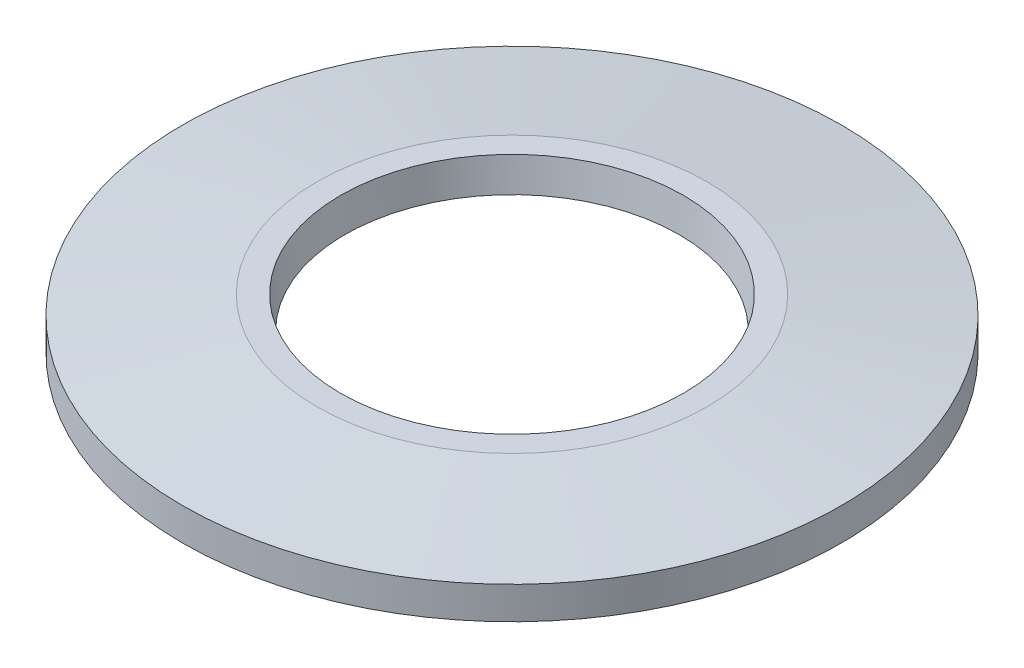
ISO-10303-21;
HEADER;
FILE_DESCRIPTION(('STEP AP214'),'2;1');
FILE_NAME('part.step','',(''),(''),'','','');
FILE_SCHEMA(('AUTOMOTIVE_DESIGN { 1 0 10303 214 1 1 1 1 }'));
ENDSEC;
DATA;
#1=APPLICATION_CONTEXT('core data for automotive mechanical design processes');
#2=APPLICATION_PROTOCOL_DEFINITION('international standard','automotive_design',2000,#1);
#3=PRODUCT_CONTEXT('',#1,'mechanical');
#4=PRODUCT('Part','Part','',(#3));
#5=PRODUCT_RELATED_PRODUCT_CATEGORY('part','',(#4));
#6=PRODUCT_DEFINITION_FORMATION('','',#4);
#7=PRODUCT_DEFINITION_CONTEXT('part definition',#1,'design');
#8=PRODUCT_DEFINITION('design','',#6,#7);
#9=PRODUCT_DEFINITION_SHAPE('','',#8);
#10=(LENGTH_UNIT() NAMED_UNIT(*) SI_UNIT(.MILLI.,.METRE.));
#11=(NAMED_UNIT(*) PLANE_ANGLE_UNIT() SI_UNIT($,.RADIAN.));
#12=(NAMED_UNIT(*) SI_UNIT($,.STERADIAN.) SOLID_ANGLE_UNIT());
#13=UNCERTAINTY_MEASURE_WITH_UNIT(LENGTH_MEASURE(1.E-05),#10,'distance_accuracy_value','');
#14=(GEOMETRIC_REPRESENTATION_CONTEXT(3) GLOBAL_UNCERTAINTY_ASSIGNED_CONTEXT((#13)) GLOBAL_UNIT_ASSIGNED_CONTEXT((#10,
#11,#12)) REPRESENTATION_CONTEXT('',''));
#15=CARTESIAN_POINT('',(0.,0.,0.));
#16=DIRECTION('',(0.,0.,1.));
#17=DIRECTION('',(1.,0.,0.));
#18=AXIS2_PLACEMENT_3D('',#15,#16,#17);
#19=CARTESIAN_POINT('',(0.,-9.29522380909999,0.));
#20=DIRECTION('',(0.,-1.,0.));
#21=DIRECTION('',(0.,0.,-1.));
#22=AXIS2_PLACEMENT_3D('',#19,#20,#21);
#23=CYLINDRICAL_SURFACE('',#22,14.);
#24=CARTESIAN_POINT('',(0.,-2.15,0.));
#25=DIRECTION('',(0.,-1.,0.));
#26=DIRECTION('',(0.,0.,-1.));
#27=AXIS2_PLACEMENT_3D('',#24,#25,#26);
#28=CIRCLE('',#27,14.);
#29=CARTESIAN_POINT('',(0.,-2.15,-14.));
#30=VERTEX_POINT('',#29);
#31=EDGE_CURVE('E10',#30,#30,#28,.T.);
#32=ORIENTED_EDGE('',*,*,#31,.F.);
#33=EDGE_LOOP('',(#32));
#34=FACE_BOUND('',#33,.T.);
#35=CARTESIAN_POINT('',(0.,-0.771320419024692,0.));
#36=DIRECTION('',(0.,-1.,0.));
#37=DIRECTION('',(0.,0.,-1.));
#38=AXIS2_PLACEMENT_3D('',#35,#36,#37);
#39=CIRCLE('',#38,14.);
#40=CARTESIAN_POINT('',(0.,-0.771320419024692,-14.));
#41=VERTEX_POINT('',#40);
#42=EDGE_CURVE('E51',#41,#41,#39,.T.);
#43=ORIENTED_EDGE('',*,*,#42,.T.);
#44=EDGE_LOOP('',(#43));
#45=FACE_BOUND('',#44,.T.);
#46=ADVANCED_FACE('F29',(#34,#45),#23,.T.);
#47=CARTESIAN_POINT('',(0.,-2.15,14.));
#48=DIRECTION('',(0.,1.,0.));
#49=DIRECTION('',(0.,0.,1.));
#50=AXIS2_PLACEMENT_3D('',#47,#48,#49);
#51=PLANE('',#50);
#52=CARTESIAN_POINT('',(0.,-2.15,0.));
#53=DIRECTION('',(0.,-1.,0.));
#54=DIRECTION('',(0.,0.,-1.));
#55=AXIS2_PLACEMENT_3D('',#52,#53,#54);
#56=CIRCLE('',#55,13.);
#57=CARTESIAN_POINT('',(0.,-2.15,-13.));
#58=VERTEX_POINT('',#57);
#59=EDGE_CURVE('E35',#58,#58,#56,.T.);
#60=ORIENTED_EDGE('',*,*,#59,.F.);
#61=EDGE_LOOP('',(#60));
#62=FACE_BOUND('',#61,.T.);
#63=ORIENTED_EDGE('',*,*,#31,.T.);
#64=EDGE_LOOP('',(#63));
#65=FACE_BOUND('',#64,.T.);
#66=ADVANCED_FACE('F76',(#62,#65),#51,.F.);
#67=CARTESIAN_POINT('',(0.,-2.15,0.));
#68=DIRECTION('',(0.,-1.,0.));
#69=DIRECTION('',(0.,0.,-1.));
#70=AXIS2_PLACEMENT_3D('',#67,#68,#69);
#71=CONICAL_SURFACE('',#70,13.,1.43669673020436);
#72=CARTESIAN_POINT('',(0.,-1.35403545266606,0.));
#73=DIRECTION('',(0.,-1.,0.));
#74=DIRECTION('',(0.,0.,-1.));
#75=AXIS2_PLACEMENT_3D('',#72,#73,#74);
#76=CIRCLE('',#75,7.1);
#77=CARTESIAN_POINT('',(0.,-1.35403545266606,-7.1));
#78=VERTEX_POINT('',#77);
#79=EDGE_CURVE('E39',#78,#78,#76,.T.);
#80=ORIENTED_EDGE('',*,*,#79,.F.);
#81=EDGE_LOOP('',(#80));
#82=FACE_BOUND('',#81,.T.);
#83=ORIENTED_EDGE('',*,*,#59,.T.);
#84=EDGE_LOOP('',(#83));
#85=FACE_BOUND('',#84,.T.);
#86=ADVANCED_FACE('F71',(#82,#85),#71,.F.);
#87=CARTESIAN_POINT('',(0.,-1.35403545266606,0.));
#88=DIRECTION('',(0.,1.,0.));
#89=DIRECTION('',(0.,0.,1.));
#90=AXIS2_PLACEMENT_3D('',#87,#88,#89);
#91=CONICAL_SURFACE('',#90,7.1,0.134099596590547);
#92=CARTESIAN_POINT('',(0.,0.,0.));
#93=DIRECTION('',(0.,-1.,0.));
#94=DIRECTION('',(0.,0.,-1.));
#95=AXIS2_PLACEMENT_3D('',#92,#93,#94);
#96=CIRCLE('',#95,7.2826719010433);
#97=CARTESIAN_POINT('',(0.,0.,-7.2826719010433));
#98=VERTEX_POINT('',#97);
#99=EDGE_CURVE('E43',#98,#98,#96,.T.);
#100=ORIENTED_EDGE('',*,*,#99,.F.);
#101=EDGE_LOOP('',(#100));
#102=FACE_BOUND('',#101,.T.);
#103=ORIENTED_EDGE('',*,*,#79,.T.);
#104=EDGE_LOOP('',(#103));
#105=FACE_BOUND('',#104,.T.);
#106=ADVANCED_FACE('F65',(#102,#105),#91,.F.);
#107=CARTESIAN_POINT('',(0.,0.,7.2826719010433));
#108=DIRECTION('',(0.,-1.,0.));
#109=DIRECTION('',(0.,0.,-1.));
#110=AXIS2_PLACEMENT_3D('',#107,#108,#109);
#111=PLANE('',#110);
#112=CARTESIAN_POINT('',(0.,0.,0.));
#113=DIRECTION('',(0.,-1.,0.));
#114=DIRECTION('',(0.,0.,-1.));
#115=AXIS2_PLACEMENT_3D('',#112,#113,#114);
#116=CIRCLE('',#115,8.2826719010433);
#117=CARTESIAN_POINT('',(0.,0.,-8.2826719010433));
#118=VERTEX_POINT('',#117);
#119=EDGE_CURVE('E48',#118,#118,#116,.T.);
#120=ORIENTED_EDGE('',*,*,#119,.F.);
#121=EDGE_LOOP('',(#120));
#122=FACE_BOUND('',#121,.T.);
#123=ORIENTED_EDGE('',*,*,#99,.T.);
#124=EDGE_LOOP('',(#123));
#125=FACE_BOUND('',#124,.T.);
#126=ADVANCED_FACE('F59',(#122,#125),#111,.F.);
#127=CARTESIAN_POINT('',(0.,0.,0.));
#128=DIRECTION('',(0.,-1.,0.));
#129=DIRECTION('',(0.,0.,-1.));
#130=AXIS2_PLACEMENT_3D('',#127,#128,#129);
#131=CONICAL_SURFACE('',#130,8.2826719010433,1.43669673020436);
#132=ORIENTED_EDGE('',*,*,#42,.F.);
#133=EDGE_LOOP('',(#132));
#134=FACE_BOUND('',#133,.T.);
#135=ORIENTED_EDGE('',*,*,#119,.T.);
#136=EDGE_LOOP('',(#135));
#137=FACE_BOUND('',#136,.T.);
#138=ADVANCED_FACE('F56',(#134,#137),#131,.T.);
#139=CLOSED_SHELL('',(#46,#66,#86,#106,#126,#138));
#140=MANIFOLD_SOLID_BREP('B2',#139);
#141=ADVANCED_BREP_SHAPE_REPRESENTATION('',(#18,#140),#14);
#142=SHAPE_DEFINITION_REPRESENTATION(#9,#141);
ENDSEC;
END-ISO-10303-21;
